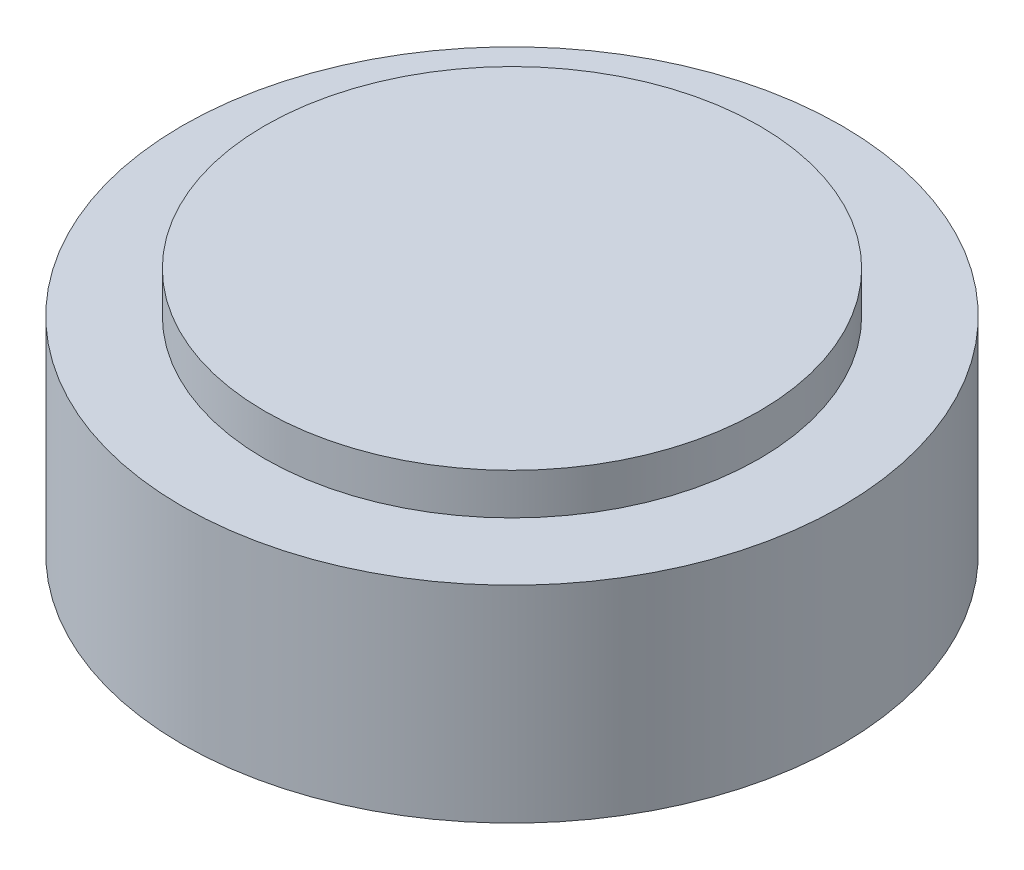
ISO-10303-21;
HEADER;
FILE_DESCRIPTION(('STEP AP214'),'2;1');
FILE_NAME('part.step','',(''),(''),'','','');
FILE_SCHEMA(('AUTOMOTIVE_DESIGN { 1 0 10303 214 1 1 1 1 }'));
ENDSEC;
DATA;
#1=APPLICATION_CONTEXT('core data for automotive mechanical design processes');
#2=APPLICATION_PROTOCOL_DEFINITION('international standard','automotive_design',2000,#1);
#3=PRODUCT_CONTEXT('',#1,'mechanical');
#4=PRODUCT('Part','Part','',(#3));
#5=PRODUCT_RELATED_PRODUCT_CATEGORY('part','',(#4));
#6=PRODUCT_DEFINITION_FORMATION('','',#4);
#7=PRODUCT_DEFINITION_CONTEXT('part definition',#1,'design');
#8=PRODUCT_DEFINITION('design','',#6,#7);
#9=PRODUCT_DEFINITION_SHAPE('','',#8);
#10=(LENGTH_UNIT() NAMED_UNIT(*) SI_UNIT(.MILLI.,.METRE.));
#11=(NAMED_UNIT(*) PLANE_ANGLE_UNIT() SI_UNIT($,.RADIAN.));
#12=(NAMED_UNIT(*) SI_UNIT($,.STERADIAN.) SOLID_ANGLE_UNIT());
#13=UNCERTAINTY_MEASURE_WITH_UNIT(LENGTH_MEASURE(1.E-05),#10,'distance_accuracy_value','');
#14=(GEOMETRIC_REPRESENTATION_CONTEXT(3) GLOBAL_UNCERTAINTY_ASSIGNED_CONTEXT((#13)) GLOBAL_UNIT_ASSIGNED_CONTEXT((#10,
#11,#12)) REPRESENTATION_CONTEXT('',''));
#15=CARTESIAN_POINT('',(0.,0.,0.));
#16=DIRECTION('',(0.,0.,1.));
#17=DIRECTION('',(1.,0.,0.));
#18=AXIS2_PLACEMENT_3D('',#15,#16,#17);
#19=CARTESIAN_POINT('',(40.,0.,0.));
#20=DIRECTION('',(0.,-1.,0.));
#21=DIRECTION('',(0.,0.,-1.));
#22=AXIS2_PLACEMENT_3D('',#19,#20,#21);
#23=PLANE('',#22);
#24=CARTESIAN_POINT('',(0.,0.,0.));
#25=DIRECTION('',(0.,-1.,0.));
#26=DIRECTION('',(0.,0.,-1.));
#27=AXIS2_PLACEMENT_3D('',#24,#25,#26);
#28=CIRCLE('',#27,14.);
#29=CARTESIAN_POINT('',(0.,0.,-14.));
#30=VERTEX_POINT('',#29);
#31=EDGE_CURVE('E60',#30,#30,#28,.T.);
#32=ORIENTED_EDGE('',*,*,#31,.F.);
#33=EDGE_LOOP('',(#32));
#34=FACE_BOUND('',#33,.T.);
#35=CARTESIAN_POINT('',(0.,0.,0.));
#36=DIRECTION('',(0.,-1.,0.));
#37=DIRECTION('',(0.,0.,-1.));
#38=AXIS2_PLACEMENT_3D('',#35,#36,#37);
#39=CIRCLE('',#38,40.);
#40=CARTESIAN_POINT('',(0.,0.,-40.));
#41=VERTEX_POINT('',#40);
#42=EDGE_CURVE('E53',#41,#41,#39,.T.);
#43=ORIENTED_EDGE('',*,*,#42,.T.);
#44=EDGE_LOOP('',(#43));
#45=FACE_BOUND('',#44,.T.);
#46=ADVANCED_FACE('F37',(#34,#45),#23,.T.);
#47=CARTESIAN_POINT('',(0.,30.,0.));
#48=DIRECTION('',(0.,1.,0.));
#49=DIRECTION('',(0.,0.,1.));
#50=AXIS2_PLACEMENT_3D('',#47,#48,#49);
#51=PLANE('',#50);
#52=CARTESIAN_POINT('',(0.,30.,0.));
#53=DIRECTION('',(0.,-1.,0.));
#54=DIRECTION('',(0.,0.,-1.));
#55=AXIS2_PLACEMENT_3D('',#52,#53,#54);
#56=CIRCLE('',#55,30.);
#57=CARTESIAN_POINT('',(0.,30.,-30.));
#58=VERTEX_POINT('',#57);
#59=EDGE_CURVE('E10',#58,#58,#56,.T.);
#60=ORIENTED_EDGE('',*,*,#59,.F.);
#61=EDGE_LOOP('',(#60));
#62=FACE_BOUND('',#61,.T.);
#63=ADVANCED_FACE('F77',(#62),#51,.T.);
#64=CARTESIAN_POINT('',(0.,0.,0.));
#65=DIRECTION('',(0.,-1.,0.));
#66=DIRECTION('',(0.,0.,-1.));
#67=AXIS2_PLACEMENT_3D('',#64,#65,#66);
#68=CYLINDRICAL_SURFACE('',#67,30.);
#69=ORIENTED_EDGE('',*,*,#59,.T.);
#70=EDGE_LOOP('',(#69));
#71=FACE_BOUND('',#70,.T.);
#72=CARTESIAN_POINT('',(0.,25.,0.));
#73=DIRECTION('',(0.,-1.,0.));
#74=DIRECTION('',(0.,0.,-1.));
#75=AXIS2_PLACEMENT_3D('',#72,#73,#74);
#76=CIRCLE('',#75,30.);
#77=CARTESIAN_POINT('',(0.,25.,-30.));
#78=VERTEX_POINT('',#77);
#79=EDGE_CURVE('E43',#78,#78,#76,.T.);
#80=ORIENTED_EDGE('',*,*,#79,.F.);
#81=EDGE_LOOP('',(#80));
#82=FACE_BOUND('',#81,.T.);
#83=ADVANCED_FACE('F86',(#71,#82),#68,.T.);
#84=CARTESIAN_POINT('',(30.,25.,0.));
#85=DIRECTION('',(0.,1.,0.));
#86=DIRECTION('',(0.,0.,1.));
#87=AXIS2_PLACEMENT_3D('',#84,#85,#86);
#88=PLANE('',#87);
#89=ORIENTED_EDGE('',*,*,#79,.T.);
#90=EDGE_LOOP('',(#89));
#91=FACE_BOUND('',#90,.T.);
#92=CARTESIAN_POINT('',(0.,25.,0.));
#93=DIRECTION('',(0.,-1.,0.));
#94=DIRECTION('',(0.,0.,-1.));
#95=AXIS2_PLACEMENT_3D('',#92,#93,#94);
#96=CIRCLE('',#95,40.);
#97=CARTESIAN_POINT('',(0.,25.,-40.));
#98=VERTEX_POINT('',#97);
#99=EDGE_CURVE('E48',#98,#98,#96,.T.);
#100=ORIENTED_EDGE('',*,*,#99,.F.);
#101=EDGE_LOOP('',(#100));
#102=FACE_BOUND('',#101,.T.);
#103=ADVANCED_FACE('F81',(#91,#102),#88,.T.);
#104=CARTESIAN_POINT('',(0.,0.,0.));
#105=DIRECTION('',(0.,-1.,0.));
#106=DIRECTION('',(0.,0.,-1.));
#107=AXIS2_PLACEMENT_3D('',#104,#105,#106);
#108=CYLINDRICAL_SURFACE('',#107,40.);
#109=ORIENTED_EDGE('',*,*,#99,.T.);
#110=EDGE_LOOP('',(#109));
#111=FACE_BOUND('',#110,.T.);
#112=ORIENTED_EDGE('',*,*,#42,.F.);
#113=EDGE_LOOP('',(#112));
#114=FACE_BOUND('',#113,.T.);
#115=ADVANCED_FACE('F71',(#111,#114),#108,.T.);
#116=CARTESIAN_POINT('',(0.,17.,0.));
#117=DIRECTION('',(0.,-1.,0.));
#118=DIRECTION('',(0.,0.,-1.));
#119=AXIS2_PLACEMENT_3D('',#116,#117,#118);
#120=CYLINDRICAL_SURFACE('',#119,14.);
#121=CARTESIAN_POINT('',(0.,17.,0.));
#122=DIRECTION('',(0.,-1.,0.));
#123=DIRECTION('',(0.,0.,-1.));
#124=AXIS2_PLACEMENT_3D('',#121,#122,#123);
#125=CIRCLE('',#124,14.);
#126=CARTESIAN_POINT('',(0.,17.,-14.));
#127=VERTEX_POINT('',#126);
#128=EDGE_CURVE('E59',#127,#127,#125,.T.);
#129=ORIENTED_EDGE('',*,*,#128,.F.);
#130=EDGE_LOOP('',(#129));
#131=FACE_BOUND('',#130,.T.);
#132=ORIENTED_EDGE('',*,*,#31,.T.);
#133=EDGE_LOOP('',(#132));
#134=FACE_BOUND('',#133,.T.);
#135=ADVANCED_FACE('F68',(#131,#134),#120,.F.);
#136=CARTESIAN_POINT('',(0.,17.,0.));
#137=DIRECTION('',(0.,-1.,0.));
#138=DIRECTION('',(0.,0.,-1.));
#139=AXIS2_PLACEMENT_3D('',#136,#137,#138);
#140=PLANE('',#139);
#141=ORIENTED_EDGE('',*,*,#128,.T.);
#142=EDGE_LOOP('',(#141));
#143=FACE_BOUND('',#142,.T.);
#144=ADVANCED_FACE('F66',(#143),#140,.T.);
#145=CLOSED_SHELL('',(#46,#63,#83,#103,#115,#135,#144));
#146=MANIFOLD_SOLID_BREP('B2',#145);
#147=ADVANCED_BREP_SHAPE_REPRESENTATION('',(#18,#146),#14);
#148=SHAPE_DEFINITION_REPRESENTATION(#9,#147);
ENDSEC;
END-ISO-10303-21;
